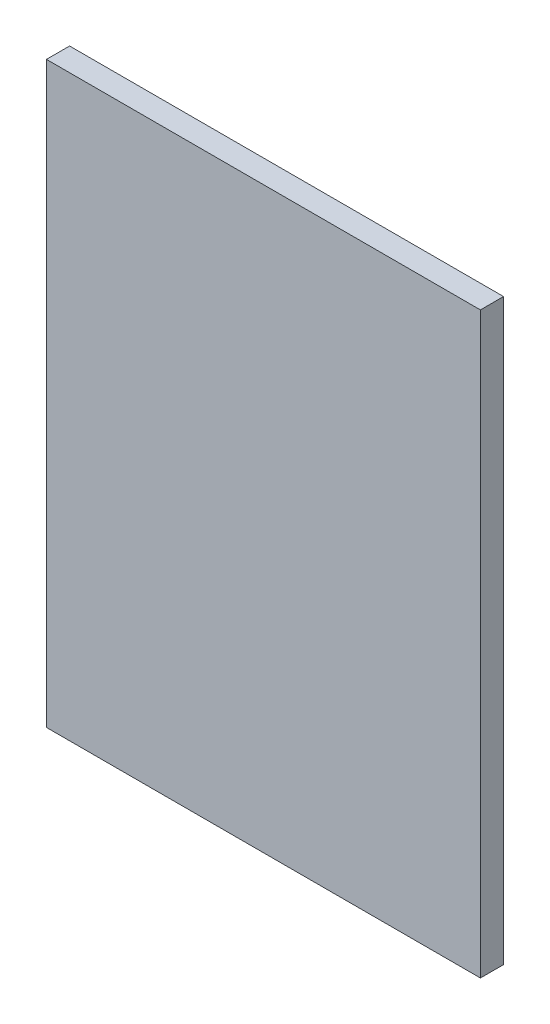
ISO-10303-21;
HEADER;
FILE_DESCRIPTION(('STEP AP214'),'2;1');
FILE_NAME('part.step','',(''),(''),'','','');
FILE_SCHEMA(('AUTOMOTIVE_DESIGN { 1 0 10303 214 1 1 1 1 }'));
ENDSEC;
DATA;
#1=APPLICATION_CONTEXT('core data for automotive mechanical design processes');
#2=APPLICATION_PROTOCOL_DEFINITION('international standard','automotive_design',2000,#1);
#3=PRODUCT_CONTEXT('',#1,'mechanical');
#4=PRODUCT('Part','Part','',(#3));
#5=PRODUCT_RELATED_PRODUCT_CATEGORY('part','',(#4));
#6=PRODUCT_DEFINITION_FORMATION('','',#4);
#7=PRODUCT_DEFINITION_CONTEXT('part definition',#1,'design');
#8=PRODUCT_DEFINITION('design','',#6,#7);
#9=PRODUCT_DEFINITION_SHAPE('','',#8);
#10=(LENGTH_UNIT() NAMED_UNIT(*) SI_UNIT(.MILLI.,.METRE.));
#11=(NAMED_UNIT(*) PLANE_ANGLE_UNIT() SI_UNIT($,.RADIAN.));
#12=(NAMED_UNIT(*) SI_UNIT($,.STERADIAN.) SOLID_ANGLE_UNIT());
#13=UNCERTAINTY_MEASURE_WITH_UNIT(LENGTH_MEASURE(1.E-05),#10,'distance_accuracy_value','');
#14=(GEOMETRIC_REPRESENTATION_CONTEXT(3) GLOBAL_UNCERTAINTY_ASSIGNED_CONTEXT((#13)) GLOBAL_UNIT_ASSIGNED_CONTEXT((#10,
#11,#12)) REPRESENTATION_CONTEXT('',''));
#15=CARTESIAN_POINT('',(0.,0.,0.));
#16=DIRECTION('',(0.,0.,1.));
#17=DIRECTION('',(1.,0.,0.));
#18=AXIS2_PLACEMENT_3D('',#15,#16,#17);
#19=CARTESIAN_POINT('',(-120.412844036697,168.119266055046,8.));
#20=DIRECTION('',(1.,0.,0.));
#21=DIRECTION('',(0.,1.,0.));
#22=AXIS2_PLACEMENT_3D('',#19,#20,#21);
#23=PLANE('',#22);
#24=DIRECTION('',(0.,-1.,0.));
#25=VECTOR('',#24,1.);
#26=CARTESIAN_POINT('',(-120.412844036697,168.119266055046,0.));
#27=LINE('',#26,#25);
#28=CARTESIAN_POINT('',(-120.412844036697,168.119266055046,0.));
#29=VERTEX_POINT('',#28);
#30=CARTESIAN_POINT('',(-120.412844036697,-31.8807339449542,0.));
#31=VERTEX_POINT('',#30);
#32=EDGE_CURVE('E96',#29,#31,#27,.T.);
#33=ORIENTED_EDGE('',*,*,#32,.T.);
#34=DIRECTION('',(0.,0.,-1.));
#35=VECTOR('',#34,1.);
#36=CARTESIAN_POINT('',(-120.412844036697,-31.8807339449542,8.));
#37=LINE('',#36,#35);
#38=CARTESIAN_POINT('',(-120.412844036697,-31.8807339449542,8.));
#39=VERTEX_POINT('',#38);
#40=EDGE_CURVE('E11',#39,#31,#37,.T.);
#41=ORIENTED_EDGE('',*,*,#40,.F.);
#42=DIRECTION('',(0.,-1.,0.));
#43=VECTOR('',#42,1.);
#44=CARTESIAN_POINT('',(-120.412844036697,168.119266055046,8.));
#45=LINE('',#44,#43);
#46=CARTESIAN_POINT('',(-120.412844036697,168.119266055046,8.));
#47=VERTEX_POINT('',#46);
#48=EDGE_CURVE('E84',#47,#39,#45,.T.);
#49=ORIENTED_EDGE('',*,*,#48,.F.);
#50=DIRECTION('',(0.,0.,-1.));
#51=VECTOR('',#50,1.);
#52=CARTESIAN_POINT('',(-120.412844036697,168.119266055046,8.));
#53=LINE('',#52,#51);
#54=EDGE_CURVE('E92',#47,#29,#53,.T.);
#55=ORIENTED_EDGE('',*,*,#54,.T.);
#56=EDGE_LOOP('',(#33,#41,#49,#55));
#57=FACE_BOUND('',#56,.T.);
#58=ADVANCED_FACE('F33',(#57),#23,.F.);
#59=CARTESIAN_POINT('',(-120.412844036697,-31.8807339449542,8.));
#60=DIRECTION('',(0.,1.,0.));
#61=DIRECTION('',(0.,0.,1.));
#62=AXIS2_PLACEMENT_3D('',#59,#60,#61);
#63=PLANE('',#62);
#64=DIRECTION('',(1.,0.,0.));
#65=VECTOR('',#64,1.);
#66=CARTESIAN_POINT('',(-120.412844036697,-31.8807339449542,0.));
#67=LINE('',#66,#65);
#68=CARTESIAN_POINT('',(29.5871559633028,-31.8807339449542,0.));
#69=VERTEX_POINT('',#68);
#70=EDGE_CURVE('E88',#31,#69,#67,.T.);
#71=ORIENTED_EDGE('',*,*,#70,.T.);
#72=DIRECTION('',(0.,0.,-1.));
#73=VECTOR('',#72,1.);
#74=CARTESIAN_POINT('',(29.5871559633028,-31.8807339449542,8.));
#75=LINE('',#74,#73);
#76=CARTESIAN_POINT('',(29.5871559633028,-31.8807339449542,8.));
#77=VERTEX_POINT('',#76);
#78=EDGE_CURVE('E41',#77,#69,#75,.T.);
#79=ORIENTED_EDGE('',*,*,#78,.F.);
#80=DIRECTION('',(1.,0.,0.));
#81=VECTOR('',#80,1.);
#82=CARTESIAN_POINT('',(-120.412844036697,-31.8807339449542,8.));
#83=LINE('',#82,#81);
#84=EDGE_CURVE('E79',#39,#77,#83,.T.);
#85=ORIENTED_EDGE('',*,*,#84,.F.);
#86=ORIENTED_EDGE('',*,*,#40,.T.);
#87=EDGE_LOOP('',(#71,#79,#85,#86));
#88=FACE_BOUND('',#87,.T.);
#89=ADVANCED_FACE('F87',(#88),#63,.F.);
#90=CARTESIAN_POINT('',(29.5871559633027,168.119266055046,8.));
#91=DIRECTION('',(-1.,0.,0.));
#92=DIRECTION('',(0.,-1.,0.));
#93=AXIS2_PLACEMENT_3D('',#90,#91,#92);
#94=PLANE('',#93);
#95=DIRECTION('',(0.,1.,0.));
#96=VECTOR('',#95,1.);
#97=CARTESIAN_POINT('',(29.5871559633027,168.119266055046,0.));
#98=LINE('',#97,#96);
#99=CARTESIAN_POINT('',(29.5871559633027,168.119266055046,0.));
#100=VERTEX_POINT('',#99);
#101=EDGE_CURVE('E66',#69,#100,#98,.T.);
#102=ORIENTED_EDGE('',*,*,#101,.T.);
#103=DIRECTION('',(0.,0.,-1.));
#104=VECTOR('',#103,1.);
#105=CARTESIAN_POINT('',(29.5871559633027,168.119266055046,8.));
#106=LINE('',#105,#104);
#107=CARTESIAN_POINT('',(29.5871559633027,168.119266055046,8.));
#108=VERTEX_POINT('',#107);
#109=EDGE_CURVE('E89',#108,#100,#106,.T.);
#110=ORIENTED_EDGE('',*,*,#109,.F.);
#111=DIRECTION('',(0.,1.,0.));
#112=VECTOR('',#111,1.);
#113=CARTESIAN_POINT('',(29.5871559633027,168.119266055046,8.));
#114=LINE('',#113,#112);
#115=EDGE_CURVE('E82',#77,#108,#114,.T.);
#116=ORIENTED_EDGE('',*,*,#115,.F.);
#117=ORIENTED_EDGE('',*,*,#78,.T.);
#118=EDGE_LOOP('',(#102,#110,#116,#117));
#119=FACE_BOUND('',#118,.T.);
#120=ADVANCED_FACE('F90',(#119),#94,.F.);
#121=CARTESIAN_POINT('',(-120.412844036697,168.119266055046,8.));
#122=DIRECTION('',(0.,-1.,0.));
#123=DIRECTION('',(0.,0.,-1.));
#124=AXIS2_PLACEMENT_3D('',#121,#122,#123);
#125=PLANE('',#124);
#126=DIRECTION('',(-1.,0.,0.));
#127=VECTOR('',#126,1.);
#128=CARTESIAN_POINT('',(-120.412844036697,168.119266055046,0.));
#129=LINE('',#128,#127);
#130=EDGE_CURVE('E72',#100,#29,#129,.T.);
#131=ORIENTED_EDGE('',*,*,#130,.T.);
#132=ORIENTED_EDGE('',*,*,#54,.F.);
#133=DIRECTION('',(-1.,0.,0.));
#134=VECTOR('',#133,1.);
#135=CARTESIAN_POINT('',(-120.412844036697,168.119266055046,8.));
#136=LINE('',#135,#134);
#137=EDGE_CURVE('E49',#108,#47,#136,.T.);
#138=ORIENTED_EDGE('',*,*,#137,.F.);
#139=ORIENTED_EDGE('',*,*,#109,.T.);
#140=EDGE_LOOP('',(#131,#132,#138,#139));
#141=FACE_BOUND('',#140,.T.);
#142=ADVANCED_FACE('F103',(#141),#125,.F.);
#143=CARTESIAN_POINT('',(0.,0.,8.));
#144=DIRECTION('',(0.,0.,1.));
#145=DIRECTION('',(1.,0.,0.));
#146=AXIS2_PLACEMENT_3D('',#143,#144,#145);
#147=PLANE('',#146);
#148=ORIENTED_EDGE('',*,*,#48,.T.);
#149=ORIENTED_EDGE('',*,*,#84,.T.);
#150=ORIENTED_EDGE('',*,*,#115,.T.);
#151=ORIENTED_EDGE('',*,*,#137,.T.);
#152=EDGE_LOOP('',(#148,#149,#150,#151));
#153=FACE_BOUND('',#152,.T.);
#154=ADVANCED_FACE('F80',(#153),#147,.T.);
#155=CARTESIAN_POINT('',(0.,0.,0.));
#156=DIRECTION('',(0.,0.,1.));
#157=DIRECTION('',(1.,0.,0.));
#158=AXIS2_PLACEMENT_3D('',#155,#156,#157);
#159=PLANE('',#158);
#160=ORIENTED_EDGE('',*,*,#32,.F.);
#161=ORIENTED_EDGE('',*,*,#130,.F.);
#162=ORIENTED_EDGE('',*,*,#101,.F.);
#163=ORIENTED_EDGE('',*,*,#70,.F.);
#164=EDGE_LOOP('',(#160,#161,#162,#163));
#165=FACE_BOUND('',#164,.T.);
#166=ADVANCED_FACE('F106',(#165),#159,.F.);
#167=CLOSED_SHELL('',(#58,#89,#120,#142,#154,#166));
#168=MANIFOLD_SOLID_BREP('B2',#167);
#169=ADVANCED_BREP_SHAPE_REPRESENTATION('',(#18,#168),#14);
#170=SHAPE_DEFINITION_REPRESENTATION(#9,#169);
ENDSEC;
END-ISO-10303-21;
